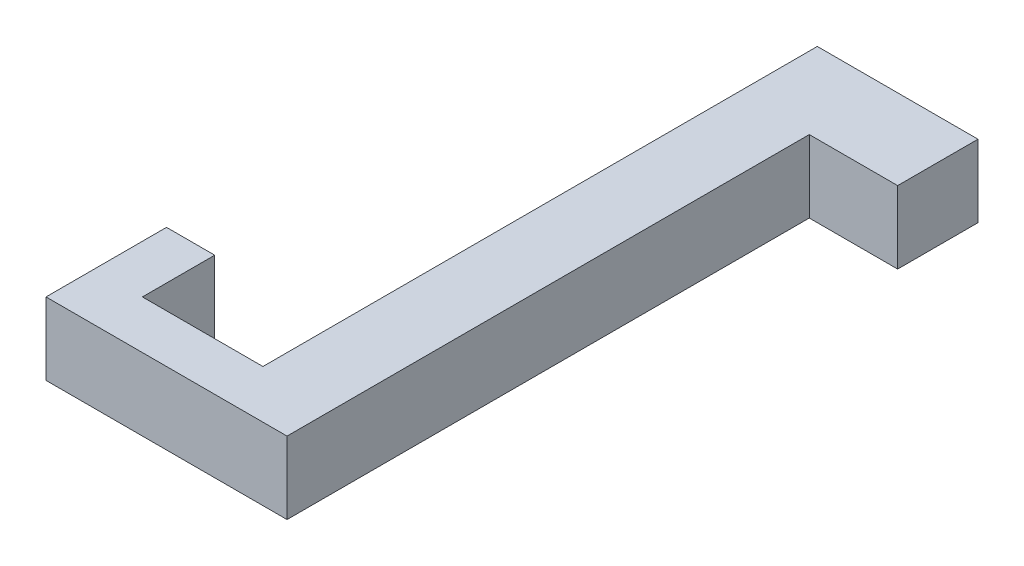
ISO-10303-21;
HEADER;
FILE_DESCRIPTION(('STEP AP214'),'2;1');
FILE_NAME('part.step','',(''),(''),'','','');
FILE_SCHEMA(('AUTOMOTIVE_DESIGN { 1 0 10303 214 1 1 1 1 }'));
ENDSEC;
DATA;
#1=APPLICATION_CONTEXT('core data for automotive mechanical design processes');
#2=APPLICATION_PROTOCOL_DEFINITION('international standard','automotive_design',2000,#1);
#3=PRODUCT_CONTEXT('',#1,'mechanical');
#4=PRODUCT('Part','Part','',(#3));
#5=PRODUCT_RELATED_PRODUCT_CATEGORY('part','',(#4));
#6=PRODUCT_DEFINITION_FORMATION('','',#4);
#7=PRODUCT_DEFINITION_CONTEXT('part definition',#1,'design');
#8=PRODUCT_DEFINITION('design','',#6,#7);
#9=PRODUCT_DEFINITION_SHAPE('','',#8);
#10=(LENGTH_UNIT() NAMED_UNIT(*) SI_UNIT(.MILLI.,.METRE.));
#11=(NAMED_UNIT(*) PLANE_ANGLE_UNIT() SI_UNIT($,.RADIAN.));
#12=(NAMED_UNIT(*) SI_UNIT($,.STERADIAN.) SOLID_ANGLE_UNIT());
#13=UNCERTAINTY_MEASURE_WITH_UNIT(LENGTH_MEASURE(1.E-05),#10,'distance_accuracy_value','');
#14=(GEOMETRIC_REPRESENTATION_CONTEXT(3) GLOBAL_UNCERTAINTY_ASSIGNED_CONTEXT((#13)) GLOBAL_UNIT_ASSIGNED_CONTEXT((#10,
#11,#12)) REPRESENTATION_CONTEXT('',''));
#15=CARTESIAN_POINT('',(0.,0.,0.));
#16=DIRECTION('',(0.,0.,1.));
#17=DIRECTION('',(1.,0.,0.));
#18=AXIS2_PLACEMENT_3D('',#15,#16,#17);
#19=CARTESIAN_POINT('',(0.,4.5,16.25));
#20=DIRECTION('',(-1.,0.,0.));
#21=DIRECTION('',(0.,0.,1.));
#22=AXIS2_PLACEMENT_3D('',#19,#20,#21);
#23=PLANE('',#22);
#24=DIRECTION('',(0.,0.,-1.));
#25=VECTOR('',#24,1.);
#26=CARTESIAN_POINT('',(0.,0.,16.25));
#27=LINE('',#26,#25);
#28=CARTESIAN_POINT('',(0.,0.,16.25));
#29=VERTEX_POINT('',#28);
#30=CARTESIAN_POINT('',(0.,0.,-16.25));
#31=VERTEX_POINT('',#30);
#32=EDGE_CURVE('E146',#29,#31,#27,.T.);
#33=ORIENTED_EDGE('',*,*,#32,.T.);
#34=DIRECTION('',(0.,-1.,0.));
#35=VECTOR('',#34,1.);
#36=CARTESIAN_POINT('',(0.,4.5,-16.25));
#37=LINE('',#36,#35);
#38=CARTESIAN_POINT('',(0.,4.5,-16.25));
#39=VERTEX_POINT('',#38);
#40=EDGE_CURVE('E11',#39,#31,#37,.T.);
#41=ORIENTED_EDGE('',*,*,#40,.F.);
#42=DIRECTION('',(0.,0.,-1.));
#43=VECTOR('',#42,1.);
#44=CARTESIAN_POINT('',(0.,4.5,16.25));
#45=LINE('',#44,#43);
#46=CARTESIAN_POINT('',(0.,4.5,16.25));
#47=VERTEX_POINT('',#46);
#48=EDGE_CURVE('E164',#47,#39,#45,.T.);
#49=ORIENTED_EDGE('',*,*,#48,.F.);
#50=DIRECTION('',(0.,-1.,0.));
#51=VECTOR('',#50,1.);
#52=CARTESIAN_POINT('',(0.,4.5,16.25));
#53=LINE('',#52,#51);
#54=EDGE_CURVE('E142',#47,#29,#53,.T.);
#55=ORIENTED_EDGE('',*,*,#54,.T.);
#56=EDGE_LOOP('',(#33,#41,#49,#55));
#57=FACE_BOUND('',#56,.T.);
#58=ADVANCED_FACE('F38',(#57),#23,.F.);
#59=CARTESIAN_POINT('',(0.,4.5,-16.25));
#60=DIRECTION('',(0.,0.,-1.));
#61=DIRECTION('',(-1.,0.,0.));
#62=AXIS2_PLACEMENT_3D('',#59,#60,#61);
#63=PLANE('',#62);
#64=DIRECTION('',(1.,0.,0.));
#65=VECTOR('',#64,1.);
#66=CARTESIAN_POINT('',(0.,0.,-16.25));
#67=LINE('',#66,#65);
#68=CARTESIAN_POINT('',(5.50000000000001,0.,-16.25));
#69=VERTEX_POINT('',#68);
#70=EDGE_CURVE('E149',#31,#69,#67,.T.);
#71=ORIENTED_EDGE('',*,*,#70,.T.);
#72=DIRECTION('',(0.,-1.,0.));
#73=VECTOR('',#72,1.);
#74=CARTESIAN_POINT('',(5.50000000000001,4.5,-16.25));
#75=LINE('',#74,#73);
#76=CARTESIAN_POINT('',(5.50000000000001,4.5,-16.25));
#77=VERTEX_POINT('',#76);
#78=EDGE_CURVE('E46',#77,#69,#75,.T.);
#79=ORIENTED_EDGE('',*,*,#78,.F.);
#80=DIRECTION('',(1.,0.,0.));
#81=VECTOR('',#80,1.);
#82=CARTESIAN_POINT('',(0.,4.5,-16.25));
#83=LINE('',#82,#81);
#84=EDGE_CURVE('E103',#39,#77,#83,.T.);
#85=ORIENTED_EDGE('',*,*,#84,.F.);
#86=ORIENTED_EDGE('',*,*,#40,.T.);
#87=EDGE_LOOP('',(#71,#79,#85,#86));
#88=FACE_BOUND('',#87,.T.);
#89=ADVANCED_FACE('F213',(#88),#63,.F.);
#90=CARTESIAN_POINT('',(5.50000000000001,4.5,-16.25));
#91=DIRECTION('',(-1.,0.,0.));
#92=DIRECTION('',(0.,0.,1.));
#93=AXIS2_PLACEMENT_3D('',#90,#91,#92);
#94=PLANE('',#93);
#95=DIRECTION('',(0.,0.,-1.));
#96=VECTOR('',#95,1.);
#97=CARTESIAN_POINT('',(5.50000000000001,0.,-16.25));
#98=LINE('',#97,#96);
#99=CARTESIAN_POINT('',(5.50000000000001,0.,-21.25));
#100=VERTEX_POINT('',#99);
#101=EDGE_CURVE('E151',#69,#100,#98,.T.);
#102=ORIENTED_EDGE('',*,*,#101,.T.);
#103=DIRECTION('',(0.,-1.,0.));
#104=VECTOR('',#103,1.);
#105=CARTESIAN_POINT('',(5.50000000000001,4.5,-21.25));
#106=LINE('',#105,#104);
#107=CARTESIAN_POINT('',(5.50000000000001,4.5,-21.25));
#108=VERTEX_POINT('',#107);
#109=EDGE_CURVE('E177',#108,#100,#106,.T.);
#110=ORIENTED_EDGE('',*,*,#109,.F.);
#111=DIRECTION('',(0.,0.,-1.));
#112=VECTOR('',#111,1.);
#113=CARTESIAN_POINT('',(5.50000000000001,4.5,-16.25));
#114=LINE('',#113,#112);
#115=EDGE_CURVE('E185',#77,#108,#114,.T.);
#116=ORIENTED_EDGE('',*,*,#115,.F.);
#117=ORIENTED_EDGE('',*,*,#78,.T.);
#118=EDGE_LOOP('',(#102,#110,#116,#117));
#119=FACE_BOUND('',#118,.T.);
#120=ADVANCED_FACE('F183',(#119),#94,.F.);
#121=CARTESIAN_POINT('',(5.50000000000001,4.5,-21.25));
#122=DIRECTION('',(0.,0.,1.));
#123=DIRECTION('',(1.,0.,0.));
#124=AXIS2_PLACEMENT_3D('',#121,#122,#123);
#125=PLANE('',#124);
#126=DIRECTION('',(-1.,0.,0.));
#127=VECTOR('',#126,1.);
#128=CARTESIAN_POINT('',(5.50000000000001,0.,-21.25));
#129=LINE('',#128,#127);
#130=CARTESIAN_POINT('',(-4.50000000000006,0.,-21.25));
#131=VERTEX_POINT('',#130);
#132=EDGE_CURVE('E153',#100,#131,#129,.T.);
#133=ORIENTED_EDGE('',*,*,#132,.T.);
#134=DIRECTION('',(0.,-1.,0.));
#135=VECTOR('',#134,1.);
#136=CARTESIAN_POINT('',(-4.50000000000006,4.5,-21.25));
#137=LINE('',#136,#135);
#138=CARTESIAN_POINT('',(-4.50000000000006,4.5,-21.25));
#139=VERTEX_POINT('',#138);
#140=EDGE_CURVE('E174',#139,#131,#137,.T.);
#141=ORIENTED_EDGE('',*,*,#140,.F.);
#142=DIRECTION('',(-1.,0.,0.));
#143=VECTOR('',#142,1.);
#144=CARTESIAN_POINT('',(5.50000000000001,4.5,-21.25));
#145=LINE('',#144,#143);
#146=EDGE_CURVE('E203',#108,#139,#145,.T.);
#147=ORIENTED_EDGE('',*,*,#146,.F.);
#148=ORIENTED_EDGE('',*,*,#109,.T.);
#149=EDGE_LOOP('',(#133,#141,#147,#148));
#150=FACE_BOUND('',#149,.T.);
#151=ADVANCED_FACE('F194',(#150),#125,.F.);
#152=CARTESIAN_POINT('',(-4.49999999999995,4.5,13.25));
#153=DIRECTION('',(1.,0.,0.));
#154=DIRECTION('',(0.,0.,-1.));
#155=AXIS2_PLACEMENT_3D('',#152,#153,#154);
#156=PLANE('',#155);
#157=DIRECTION('',(0.,0.,1.));
#158=VECTOR('',#157,1.);
#159=CARTESIAN_POINT('',(-4.49999999999995,0.,13.25));
#160=LINE('',#159,#158);
#161=CARTESIAN_POINT('',(-4.49999999999995,0.,13.25));
#162=VERTEX_POINT('',#161);
#163=EDGE_CURVE('E155',#131,#162,#160,.T.);
#164=ORIENTED_EDGE('',*,*,#163,.T.);
#165=DIRECTION('',(0.,-1.,0.));
#166=VECTOR('',#165,1.);
#167=CARTESIAN_POINT('',(-4.49999999999995,4.5,13.25));
#168=LINE('',#167,#166);
#169=CARTESIAN_POINT('',(-4.49999999999995,4.5,13.25));
#170=VERTEX_POINT('',#169);
#171=EDGE_CURVE('E171',#170,#162,#168,.T.);
#172=ORIENTED_EDGE('',*,*,#171,.F.);
#173=DIRECTION('',(0.,0.,1.));
#174=VECTOR('',#173,1.);
#175=CARTESIAN_POINT('',(-4.49999999999995,4.5,13.25));
#176=LINE('',#175,#174);
#177=EDGE_CURVE('E200',#139,#170,#176,.T.);
#178=ORIENTED_EDGE('',*,*,#177,.F.);
#179=ORIENTED_EDGE('',*,*,#140,.T.);
#180=EDGE_LOOP('',(#164,#172,#178,#179));
#181=FACE_BOUND('',#180,.T.);
#182=ADVANCED_FACE('F198',(#181),#156,.F.);
#183=CARTESIAN_POINT('',(-12.0000000000001,4.5,13.25));
#184=DIRECTION('',(0.,0.,1.));
#185=DIRECTION('',(1.,0.,0.));
#186=AXIS2_PLACEMENT_3D('',#183,#184,#185);
#187=PLANE('',#186);
#188=DIRECTION('',(-1.,0.,0.));
#189=VECTOR('',#188,1.);
#190=CARTESIAN_POINT('',(-12.0000000000001,0.,13.25));
#191=LINE('',#190,#189);
#192=CARTESIAN_POINT('',(-12.0000000000001,0.,13.25));
#193=VERTEX_POINT('',#192);
#194=EDGE_CURVE('E157',#162,#193,#191,.T.);
#195=ORIENTED_EDGE('',*,*,#194,.T.);
#196=DIRECTION('',(0.,-1.,0.));
#197=VECTOR('',#196,1.);
#198=CARTESIAN_POINT('',(-12.0000000000001,4.5,13.25));
#199=LINE('',#198,#197);
#200=CARTESIAN_POINT('',(-12.0000000000001,4.5,13.25));
#201=VERTEX_POINT('',#200);
#202=EDGE_CURVE('E168',#201,#193,#199,.T.);
#203=ORIENTED_EDGE('',*,*,#202,.F.);
#204=DIRECTION('',(-1.,0.,0.));
#205=VECTOR('',#204,1.);
#206=CARTESIAN_POINT('',(-12.0000000000001,4.5,13.25));
#207=LINE('',#206,#205);
#208=EDGE_CURVE('E202',#170,#201,#207,.T.);
#209=ORIENTED_EDGE('',*,*,#208,.F.);
#210=ORIENTED_EDGE('',*,*,#171,.T.);
#211=EDGE_LOOP('',(#195,#203,#209,#210));
#212=FACE_BOUND('',#211,.T.);
#213=ADVANCED_FACE('F225',(#212),#187,.F.);
#214=CARTESIAN_POINT('',(-12.0000000000001,4.5,8.75000000000001));
#215=DIRECTION('',(-1.,0.,0.));
#216=DIRECTION('',(0.,0.,1.));
#217=AXIS2_PLACEMENT_3D('',#214,#215,#216);
#218=PLANE('',#217);
#219=DIRECTION('',(0.,0.,-1.));
#220=VECTOR('',#219,1.);
#221=CARTESIAN_POINT('',(-12.0000000000001,0.,8.75000000000001));
#222=LINE('',#221,#220);
#223=CARTESIAN_POINT('',(-12.0000000000001,0.,8.75000000000001));
#224=VERTEX_POINT('',#223);
#225=EDGE_CURVE('E159',#193,#224,#222,.T.);
#226=ORIENTED_EDGE('',*,*,#225,.T.);
#227=DIRECTION('',(0.,-1.,0.));
#228=VECTOR('',#227,1.);
#229=CARTESIAN_POINT('',(-12.0000000000001,4.5,8.75000000000001));
#230=LINE('',#229,#228);
#231=CARTESIAN_POINT('',(-12.0000000000001,4.5,8.75000000000001));
#232=VERTEX_POINT('',#231);
#233=EDGE_CURVE('E137',#232,#224,#230,.T.);
#234=ORIENTED_EDGE('',*,*,#233,.F.);
#235=DIRECTION('',(0.,0.,-1.));
#236=VECTOR('',#235,1.);
#237=CARTESIAN_POINT('',(-12.0000000000001,4.5,8.75000000000001));
#238=LINE('',#237,#236);
#239=EDGE_CURVE('E128',#201,#232,#238,.T.);
#240=ORIENTED_EDGE('',*,*,#239,.F.);
#241=ORIENTED_EDGE('',*,*,#202,.T.);
#242=EDGE_LOOP('',(#226,#234,#240,#241));
#243=FACE_BOUND('',#242,.T.);
#244=ADVANCED_FACE('F228',(#243),#218,.F.);
#245=CARTESIAN_POINT('',(-15.,4.5,8.75000000000001));
#246=DIRECTION('',(0.,0.,1.));
#247=DIRECTION('',(1.,0.,0.));
#248=AXIS2_PLACEMENT_3D('',#245,#246,#247);
#249=PLANE('',#248);
#250=DIRECTION('',(-1.,0.,0.));
#251=VECTOR('',#250,1.);
#252=CARTESIAN_POINT('',(-15.,0.,8.75000000000001));
#253=LINE('',#252,#251);
#254=CARTESIAN_POINT('',(-15.,0.,8.75000000000001));
#255=VERTEX_POINT('',#254);
#256=EDGE_CURVE('E136',#224,#255,#253,.T.);
#257=ORIENTED_EDGE('',*,*,#256,.T.);
#258=DIRECTION('',(0.,-1.,0.));
#259=VECTOR('',#258,1.);
#260=CARTESIAN_POINT('',(-15.,4.5,8.75000000000001));
#261=LINE('',#260,#259);
#262=CARTESIAN_POINT('',(-15.,4.5,8.75000000000001));
#263=VERTEX_POINT('',#262);
#264=EDGE_CURVE('E133',#263,#255,#261,.T.);
#265=ORIENTED_EDGE('',*,*,#264,.F.);
#266=DIRECTION('',(-1.,0.,0.));
#267=VECTOR('',#266,1.);
#268=CARTESIAN_POINT('',(-15.,4.5,8.75000000000001));
#269=LINE('',#268,#267);
#270=EDGE_CURVE('E122',#232,#263,#269,.T.);
#271=ORIENTED_EDGE('',*,*,#270,.F.);
#272=ORIENTED_EDGE('',*,*,#233,.T.);
#273=EDGE_LOOP('',(#257,#265,#271,#272));
#274=FACE_BOUND('',#273,.T.);
#275=ADVANCED_FACE('F134',(#274),#249,.F.);
#276=CARTESIAN_POINT('',(-15.,4.5,16.25));
#277=DIRECTION('',(1.,0.,0.));
#278=DIRECTION('',(0.,0.,-1.));
#279=AXIS2_PLACEMENT_3D('',#276,#277,#278);
#280=PLANE('',#279);
#281=DIRECTION('',(0.,0.,1.));
#282=VECTOR('',#281,1.);
#283=CARTESIAN_POINT('',(-15.,0.,16.25));
#284=LINE('',#283,#282);
#285=CARTESIAN_POINT('',(-15.,0.,16.25));
#286=VERTEX_POINT('',#285);
#287=EDGE_CURVE('E89',#255,#286,#284,.T.);
#288=ORIENTED_EDGE('',*,*,#287,.T.);
#289=DIRECTION('',(0.,-1.,0.));
#290=VECTOR('',#289,1.);
#291=CARTESIAN_POINT('',(-15.,4.5,16.25));
#292=LINE('',#291,#290);
#293=CARTESIAN_POINT('',(-15.,4.5,16.25));
#294=VERTEX_POINT('',#293);
#295=EDGE_CURVE('E138',#294,#286,#292,.T.);
#296=ORIENTED_EDGE('',*,*,#295,.F.);
#297=DIRECTION('',(0.,0.,1.));
#298=VECTOR('',#297,1.);
#299=CARTESIAN_POINT('',(-15.,4.5,16.25));
#300=LINE('',#299,#298);
#301=EDGE_CURVE('E126',#263,#294,#300,.T.);
#302=ORIENTED_EDGE('',*,*,#301,.F.);
#303=ORIENTED_EDGE('',*,*,#264,.T.);
#304=EDGE_LOOP('',(#288,#296,#302,#303));
#305=FACE_BOUND('',#304,.T.);
#306=ADVANCED_FACE('F140',(#305),#280,.F.);
#307=CARTESIAN_POINT('',(0.,4.5,16.25));
#308=DIRECTION('',(0.,0.,-1.));
#309=DIRECTION('',(-1.,0.,0.));
#310=AXIS2_PLACEMENT_3D('',#307,#308,#309);
#311=PLANE('',#310);
#312=DIRECTION('',(1.,0.,0.));
#313=VECTOR('',#312,1.);
#314=CARTESIAN_POINT('',(0.,0.,16.25));
#315=LINE('',#314,#313);
#316=EDGE_CURVE('E95',#286,#29,#315,.T.);
#317=ORIENTED_EDGE('',*,*,#316,.T.);
#318=ORIENTED_EDGE('',*,*,#54,.F.);
#319=DIRECTION('',(1.,0.,0.));
#320=VECTOR('',#319,1.);
#321=CARTESIAN_POINT('',(0.,4.5,16.25));
#322=LINE('',#321,#320);
#323=EDGE_CURVE('E54',#294,#47,#322,.T.);
#324=ORIENTED_EDGE('',*,*,#323,.F.);
#325=ORIENTED_EDGE('',*,*,#295,.T.);
#326=EDGE_LOOP('',(#317,#318,#324,#325));
#327=FACE_BOUND('',#326,.T.);
#328=ADVANCED_FACE('F237',(#327),#311,.F.);
#329=CARTESIAN_POINT('',(0.,4.5,0.));
#330=DIRECTION('',(0.,-1.,0.));
#331=DIRECTION('',(0.,0.,-1.));
#332=AXIS2_PLACEMENT_3D('',#329,#330,#331);
#333=PLANE('',#332);
#334=ORIENTED_EDGE('',*,*,#48,.T.);
#335=ORIENTED_EDGE('',*,*,#84,.T.);
#336=ORIENTED_EDGE('',*,*,#115,.T.);
#337=ORIENTED_EDGE('',*,*,#146,.T.);
#338=ORIENTED_EDGE('',*,*,#177,.T.);
#339=ORIENTED_EDGE('',*,*,#208,.T.);
#340=ORIENTED_EDGE('',*,*,#239,.T.);
#341=ORIENTED_EDGE('',*,*,#270,.T.);
#342=ORIENTED_EDGE('',*,*,#301,.T.);
#343=ORIENTED_EDGE('',*,*,#323,.T.);
#344=EDGE_LOOP('',(#334,#335,#336,#337,#338,#339,#340,#341,#342,#343));
#345=FACE_BOUND('',#344,.T.);
#346=ADVANCED_FACE('F124',(#345),#333,.F.);
#347=CARTESIAN_POINT('',(0.,0.,0.));
#348=DIRECTION('',(0.,-1.,0.));
#349=DIRECTION('',(0.,0.,-1.));
#350=AXIS2_PLACEMENT_3D('',#347,#348,#349);
#351=PLANE('',#350);
#352=ORIENTED_EDGE('',*,*,#32,.F.);
#353=ORIENTED_EDGE('',*,*,#316,.F.);
#354=ORIENTED_EDGE('',*,*,#287,.F.);
#355=ORIENTED_EDGE('',*,*,#256,.F.);
#356=ORIENTED_EDGE('',*,*,#225,.F.);
#357=ORIENTED_EDGE('',*,*,#194,.F.);
#358=ORIENTED_EDGE('',*,*,#163,.F.);
#359=ORIENTED_EDGE('',*,*,#132,.F.);
#360=ORIENTED_EDGE('',*,*,#101,.F.);
#361=ORIENTED_EDGE('',*,*,#70,.F.);
#362=EDGE_LOOP('',(#352,#353,#354,#355,#356,#357,#358,#359,#360,#361));
#363=FACE_BOUND('',#362,.T.);
#364=ADVANCED_FACE('F189',(#363),#351,.T.);
#365=CLOSED_SHELL('',(#58,#89,#120,#151,#182,#213,#244,#275,#306,#328,#346,#364));
#366=MANIFOLD_SOLID_BREP('B2',#365);
#367=ADVANCED_BREP_SHAPE_REPRESENTATION('',(#18,#366),#14);
#368=SHAPE_DEFINITION_REPRESENTATION(#9,#367);
ENDSEC;
END-ISO-10303-21;
